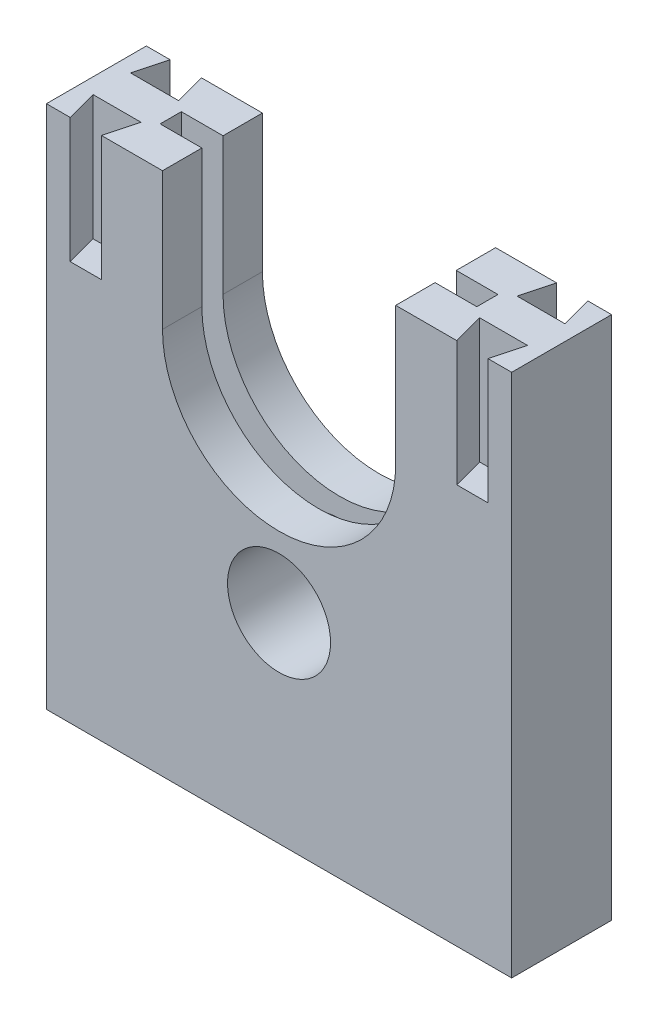
ISO-10303-21;
HEADER;
FILE_DESCRIPTION(('STEP AP214'),'2;1');
FILE_NAME('part.step','',(''),(''),'','','');
FILE_SCHEMA(('AUTOMOTIVE_DESIGN { 1 0 10303 214 1 1 1 1 }'));
ENDSEC;
DATA;
#1=APPLICATION_CONTEXT('core data for automotive mechanical design processes');
#2=APPLICATION_PROTOCOL_DEFINITION('international standard','automotive_design',2000,#1);
#3=PRODUCT_CONTEXT('',#1,'mechanical');
#4=PRODUCT('Part','Part','',(#3));
#5=PRODUCT_RELATED_PRODUCT_CATEGORY('part','',(#4));
#6=PRODUCT_DEFINITION_FORMATION('','',#4);
#7=PRODUCT_DEFINITION_CONTEXT('part definition',#1,'design');
#8=PRODUCT_DEFINITION('design','',#6,#7);
#9=PRODUCT_DEFINITION_SHAPE('','',#8);
#10=(LENGTH_UNIT() NAMED_UNIT(*) SI_UNIT(.MILLI.,.METRE.));
#11=(NAMED_UNIT(*) PLANE_ANGLE_UNIT() SI_UNIT($,.RADIAN.));
#12=(NAMED_UNIT(*) SI_UNIT($,.STERADIAN.) SOLID_ANGLE_UNIT());
#13=UNCERTAINTY_MEASURE_WITH_UNIT(LENGTH_MEASURE(1.E-05),#10,'distance_accuracy_value','');
#14=(GEOMETRIC_REPRESENTATION_CONTEXT(3) GLOBAL_UNCERTAINTY_ASSIGNED_CONTEXT((#13)) GLOBAL_UNIT_ASSIGNED_CONTEXT((#10,
#11,#12)) REPRESENTATION_CONTEXT('',''));
#15=CARTESIAN_POINT('',(0.,0.,0.));
#16=DIRECTION('',(0.,0.,1.));
#17=DIRECTION('',(1.,0.,0.));
#18=AXIS2_PLACEMENT_3D('',#15,#16,#17);
#19=CARTESIAN_POINT('',(0.,7.46153846153847,0.));
#20=DIRECTION('',(0.,-1.,0.));
#21=DIRECTION('',(0.,0.,-1.));
#22=AXIS2_PLACEMENT_3D('',#19,#20,#21);
#23=PLANE('',#22);
#24=DIRECTION('',(-1.,0.,0.));
#25=VECTOR('',#24,1.);
#26=CARTESIAN_POINT('',(-14.164150506298,7.46153846153847,3.15229744595904));
#27=LINE('',#26,#25);
#28=CARTESIAN_POINT('',(11.189791531939,7.46153846153847,3.15229744595904));
#29=VERTEX_POINT('',#28);
#30=CARTESIAN_POINT('',(2.51009255900295,7.46153846153847,3.15229744595904));
#31=VERTEX_POINT('',#30);
#32=EDGE_CURVE('E342',#29,#31,#27,.T.);
#33=ORIENTED_EDGE('',*,*,#32,.T.);
#34=DIRECTION('',(0.,0.,1.));
#35=VECTOR('',#34,1.);
#36=CARTESIAN_POINT('',(2.51009255900295,7.46153846153847,0.900000000000001));
#37=LINE('',#36,#35);
#38=CARTESIAN_POINT('',(2.51009255900295,7.46153846153847,4.84770255404097));
#39=VERTEX_POINT('',#38);
#40=EDGE_CURVE('E11',#31,#39,#37,.T.);
#41=ORIENTED_EDGE('',*,*,#40,.T.);
#42=DIRECTION('',(1.,0.,0.));
#43=VECTOR('',#42,1.);
#44=CARTESIAN_POINT('',(-14.164150506298,7.46153846153847,4.84770255404097));
#45=LINE('',#44,#43);
#46=CARTESIAN_POINT('',(11.189791531939,7.46153846153847,4.84770255404097));
#47=VERTEX_POINT('',#46);
#48=EDGE_CURVE('E350',#39,#47,#45,.T.);
#49=ORIENTED_EDGE('',*,*,#48,.T.);
#50=DIRECTION('',(0.,0.,-1.));
#51=VECTOR('',#50,1.);
#52=CARTESIAN_POINT('',(11.189791531939,7.46153846153847,4.84770255404097));
#53=LINE('',#52,#51);
#54=EDGE_CURVE('E336',#47,#29,#53,.T.);
#55=ORIENTED_EDGE('',*,*,#54,.T.);
#56=EDGE_LOOP('',(#33,#41,#49,#55));
#57=FACE_BOUND('',#56,.T.);
#58=ADVANCED_FACE('F43',(#57),#23,.F.);
#59=CARTESIAN_POINT('',(-1.4871794871795,21.4615384615385,-2.));
#60=DIRECTION('',(0.,0.,1.));
#61=DIRECTION('',(1.,0.,0.));
#62=AXIS2_PLACEMENT_3D('',#59,#60,#61);
#63=CYLINDRICAL_SURFACE('',#62,9.33629045959129);
#64=DIRECTION('',(0.,0.,1.));
#65=VECTOR('',#64,1.);
#66=CARTESIAN_POINT('',(7.84911097241179,21.4615384615385,-2.));
#67=LINE('',#66,#65);
#68=CARTESIAN_POINT('',(7.84911097241179,21.4615384615385,4.84770255404097));
#69=VERTEX_POINT('',#68);
#70=CARTESIAN_POINT('',(7.84911097241179,21.4615384615385,8.));
#71=VERTEX_POINT('',#70);
#72=EDGE_CURVE('E410',#69,#71,#67,.T.);
#73=ORIENTED_EDGE('',*,*,#72,.F.);
#74=CARTESIAN_POINT('',(-1.4871794871795,21.4615384615385,4.84770255404097));
#75=DIRECTION('',(0.,0.,1.));
#76=DIRECTION('',(1.,0.,0.));
#77=AXIS2_PLACEMENT_3D('',#74,#75,#76);
#78=CIRCLE('',#77,9.33629045959129);
#79=CARTESIAN_POINT('',(-10.8234699467708,21.4615384615385,4.84770255404097));
#80=VERTEX_POINT('',#79);
#81=EDGE_CURVE('E390',#69,#80,#78,.F.);
#82=ORIENTED_EDGE('',*,*,#81,.T.);
#83=DIRECTION('',(0.,0.,1.));
#84=VECTOR('',#83,1.);
#85=CARTESIAN_POINT('',(-10.8234699467708,21.4615384615385,-2.));
#86=LINE('',#85,#84);
#87=CARTESIAN_POINT('',(-10.8234699467708,21.4615384615385,8.));
#88=VERTEX_POINT('',#87);
#89=EDGE_CURVE('E416',#80,#88,#86,.T.);
#90=ORIENTED_EDGE('',*,*,#89,.T.);
#91=CARTESIAN_POINT('',(-1.4871794871795,21.4615384615385,8.));
#92=DIRECTION('',(0.,0.,1.));
#93=DIRECTION('',(1.,0.,0.));
#94=AXIS2_PLACEMENT_3D('',#91,#92,#93);
#95=CIRCLE('',#94,9.33629045959129);
#96=EDGE_CURVE('E398',#88,#71,#95,.T.);
#97=ORIENTED_EDGE('',*,*,#96,.T.);
#98=EDGE_LOOP('',(#73,#82,#90,#97));
#99=FACE_BOUND('',#98,.T.);
#100=ADVANCED_FACE('F705',(#99),#63,.F.);
#101=CARTESIAN_POINT('',(-10.8234699467708,21.4615384615385,-2.));
#102=DIRECTION('',(-1.,0.,0.));
#103=DIRECTION('',(0.,0.,1.));
#104=AXIS2_PLACEMENT_3D('',#101,#102,#103);
#105=PLANE('',#104);
#106=ORIENTED_EDGE('',*,*,#89,.F.);
#107=DIRECTION('',(0.,1.,0.));
#108=VECTOR('',#107,1.);
#109=CARTESIAN_POINT('',(-10.8234699467708,21.4615384615385,4.84770255404097));
#110=LINE('',#109,#108);
#111=CARTESIAN_POINT('',(-10.8234699467708,32.4615384615385,4.84770255404097));
#112=VERTEX_POINT('',#111);
#113=EDGE_CURVE('E394',#80,#112,#110,.T.);
#114=ORIENTED_EDGE('',*,*,#113,.T.);
#115=DIRECTION('',(0.,0.,1.));
#116=VECTOR('',#115,1.);
#117=CARTESIAN_POINT('',(-10.8234699467708,32.4615384615385,-2.));
#118=LINE('',#117,#116);
#119=CARTESIAN_POINT('',(-10.8234699467708,32.4615384615385,8.));
#120=VERTEX_POINT('',#119);
#121=EDGE_CURVE('E421',#112,#120,#118,.T.);
#122=ORIENTED_EDGE('',*,*,#121,.T.);
#123=DIRECTION('',(0.,-1.,0.));
#124=VECTOR('',#123,1.);
#125=CARTESIAN_POINT('',(-10.8234699467708,21.4615384615385,8.));
#126=LINE('',#125,#124);
#127=EDGE_CURVE('E406',#120,#88,#126,.T.);
#128=ORIENTED_EDGE('',*,*,#127,.T.);
#129=EDGE_LOOP('',(#106,#114,#122,#128));
#130=FACE_BOUND('',#129,.T.);
#131=ADVANCED_FACE('F642',(#130),#105,.F.);
#132=CARTESIAN_POINT('',(7.84911097241179,21.4615384615385,-2.));
#133=DIRECTION('',(1.,0.,0.));
#134=DIRECTION('',(0.,0.,-1.));
#135=AXIS2_PLACEMENT_3D('',#132,#133,#134);
#136=PLANE('',#135);
#137=DIRECTION('',(0.,0.,1.));
#138=VECTOR('',#137,1.);
#139=CARTESIAN_POINT('',(7.84911097241179,32.4615384615385,-2.));
#140=LINE('',#139,#138);
#141=CARTESIAN_POINT('',(7.84911097241179,32.4615384615385,4.84770255404097));
#142=VERTEX_POINT('',#141);
#143=CARTESIAN_POINT('',(7.84911097241179,32.4615384615385,8.));
#144=VERTEX_POINT('',#143);
#145=EDGE_CURVE('E426',#142,#144,#140,.T.);
#146=ORIENTED_EDGE('',*,*,#145,.F.);
#147=DIRECTION('',(0.,-1.,0.));
#148=VECTOR('',#147,1.);
#149=CARTESIAN_POINT('',(7.84911097241179,21.4615384615385,4.84770255404097));
#150=LINE('',#149,#148);
#151=EDGE_CURVE('E612',#142,#69,#150,.T.);
#152=ORIENTED_EDGE('',*,*,#151,.T.);
#153=ORIENTED_EDGE('',*,*,#72,.T.);
#154=DIRECTION('',(0.,1.,0.));
#155=VECTOR('',#154,1.);
#156=CARTESIAN_POINT('',(7.84911097241179,21.4615384615385,8.));
#157=LINE('',#156,#155);
#158=EDGE_CURVE('E402',#71,#144,#157,.T.);
#159=ORIENTED_EDGE('',*,*,#158,.T.);
#160=EDGE_LOOP('',(#146,#152,#153,#159));
#161=FACE_BOUND('',#160,.T.);
#162=ADVANCED_FACE('F703',(#161),#136,.F.);
#163=CARTESIAN_POINT('',(-19.4871794871795,32.4615384615385,8.));
#164=DIRECTION('',(0.,-1.,0.));
#165=DIRECTION('',(0.,0.,-1.));
#166=AXIS2_PLACEMENT_3D('',#163,#164,#165);
#167=PLANE('',#166);
#168=ORIENTED_EDGE('',*,*,#121,.F.);
#169=DIRECTION('',(1.,0.,0.));
#170=VECTOR('',#169,1.);
#171=CARTESIAN_POINT('',(-14.164150506298,32.4615384615385,4.84770255404097));
#172=LINE('',#171,#170);
#173=CARTESIAN_POINT('',(-14.164150506298,32.4615384615385,4.84770255404097));
#174=VERTEX_POINT('',#173);
#175=EDGE_CURVE('E341',#174,#112,#172,.T.);
#176=ORIENTED_EDGE('',*,*,#175,.F.);
#177=DIRECTION('',(0.,0.,1.));
#178=VECTOR('',#177,1.);
#179=CARTESIAN_POINT('',(-14.164150506298,32.4615384615385,4.84770255404097));
#180=LINE('',#179,#178);
#181=CARTESIAN_POINT('',(-14.164150506298,32.4615384615385,3.15229744595904));
#182=VERTEX_POINT('',#181);
#183=EDGE_CURVE('E362',#182,#174,#180,.T.);
#184=ORIENTED_EDGE('',*,*,#183,.F.);
#185=DIRECTION('',(-1.,0.,0.));
#186=VECTOR('',#185,1.);
#187=CARTESIAN_POINT('',(-14.164150506298,32.4615384615385,3.15229744595904));
#188=LINE('',#187,#186);
#189=CARTESIAN_POINT('',(-10.8234699467708,32.4615384615385,3.15229744595904));
#190=VERTEX_POINT('',#189);
#191=EDGE_CURVE('E359',#190,#182,#188,.T.);
#192=ORIENTED_EDGE('',*,*,#191,.F.);
#193=CARTESIAN_POINT('',(-10.8234699467708,32.4615384615385,0.));
#194=VERTEX_POINT('',#193);
#195=EDGE_CURVE('E417',#194,#190,#118,.T.);
#196=ORIENTED_EDGE('',*,*,#195,.F.);
#197=DIRECTION('',(-1.,0.,0.));
#198=VECTOR('',#197,1.);
#199=CARTESIAN_POINT('',(-19.4871794871795,32.4615384615385,0.));
#200=LINE('',#199,#198);
#201=CARTESIAN_POINT('',(-15.7121794871795,32.4615384615385,0.));
#202=VERTEX_POINT('',#201);
#203=EDGE_CURVE('E282',#194,#202,#200,.T.);
#204=ORIENTED_EDGE('',*,*,#203,.T.);
#205=DIRECTION('',(-0.258819045102518,0.,-0.965925826289069));
#206=VECTOR('',#205,1.);
#207=CARTESIAN_POINT('',(-15.0423065061017,32.4615384615385,2.5));
#208=LINE('',#207,#206);
#209=CARTESIAN_POINT('',(-15.0423065061017,32.4615384615385,2.5));
#210=VERTEX_POINT('',#209);
#211=EDGE_CURVE('E552',#210,#202,#208,.T.);
#212=ORIENTED_EDGE('',*,*,#211,.F.);
#213=DIRECTION('',(1.,0.,0.));
#214=VECTOR('',#213,1.);
#215=CARTESIAN_POINT('',(-18.8820524682573,32.4615384615385,2.5));
#216=LINE('',#215,#214);
#217=CARTESIAN_POINT('',(-18.8820524682573,32.4615384615385,2.5));
#218=VERTEX_POINT('',#217);
#219=EDGE_CURVE('E567',#218,#210,#216,.T.);
#220=ORIENTED_EDGE('',*,*,#219,.F.);
#221=DIRECTION('',(-0.258819045102517,0.,0.965925826289069));
#222=VECTOR('',#221,1.);
#223=CARTESIAN_POINT('',(-18.2121794871795,32.4615384615385,0.));
#224=LINE('',#223,#222);
#225=CARTESIAN_POINT('',(-18.2121794871795,32.4615384615385,0.));
#226=VERTEX_POINT('',#225);
#227=EDGE_CURVE('E497',#226,#218,#224,.T.);
#228=ORIENTED_EDGE('',*,*,#227,.F.);
#229=CARTESIAN_POINT('',(-20.1171794871795,32.4615384615385,0.));
#230=VERTEX_POINT('',#229);
#231=EDGE_CURVE('E596',#226,#230,#200,.T.);
#232=ORIENTED_EDGE('',*,*,#231,.T.);
#233=DIRECTION('',(0.,0.,1.));
#234=VECTOR('',#233,1.);
#235=CARTESIAN_POINT('',(-20.1171794871795,32.4615384615385,0.));
#236=LINE('',#235,#234);
#237=CARTESIAN_POINT('',(-20.1171794871795,32.4615384615385,8.));
#238=VERTEX_POINT('',#237);
#239=EDGE_CURVE('E300',#230,#238,#236,.T.);
#240=ORIENTED_EDGE('',*,*,#239,.T.);
#241=DIRECTION('',(-1.,0.,0.));
#242=VECTOR('',#241,1.);
#243=CARTESIAN_POINT('',(-19.4871794871795,32.4615384615385,8.));
#244=LINE('',#243,#242);
#245=CARTESIAN_POINT('',(-18.2121794871795,32.4615384615385,8.));
#246=VERTEX_POINT('',#245);
#247=EDGE_CURVE('E589',#246,#238,#244,.T.);
#248=ORIENTED_EDGE('',*,*,#247,.F.);
#249=DIRECTION('',(0.258819045102519,0.,0.965925826289069));
#250=VECTOR('',#249,1.);
#251=CARTESIAN_POINT('',(-18.2121794871795,32.4615384615385,8.));
#252=LINE('',#251,#250);
#253=CARTESIAN_POINT('',(-18.8820524682573,32.4615384615385,5.5));
#254=VERTEX_POINT('',#253);
#255=EDGE_CURVE('E485',#254,#246,#252,.T.);
#256=ORIENTED_EDGE('',*,*,#255,.F.);
#257=DIRECTION('',(-1.,0.,0.));
#258=VECTOR('',#257,1.);
#259=CARTESIAN_POINT('',(-18.8820524682573,32.4615384615385,5.5));
#260=LINE('',#259,#258);
#261=CARTESIAN_POINT('',(-15.0423065061017,32.4615384615385,5.5));
#262=VERTEX_POINT('',#261);
#263=EDGE_CURVE('E488',#262,#254,#260,.T.);
#264=ORIENTED_EDGE('',*,*,#263,.F.);
#265=DIRECTION('',(0.258819045102518,0.,-0.965925826289069));
#266=VECTOR('',#265,1.);
#267=CARTESIAN_POINT('',(-15.0423065061017,32.4615384615385,5.5));
#268=LINE('',#267,#266);
#269=CARTESIAN_POINT('',(-15.7121794871795,32.4615384615385,8.));
#270=VERTEX_POINT('',#269);
#271=EDGE_CURVE('E493',#270,#262,#268,.T.);
#272=ORIENTED_EDGE('',*,*,#271,.F.);
#273=EDGE_CURVE('E594',#120,#270,#244,.T.);
#274=ORIENTED_EDGE('',*,*,#273,.F.);
#275=EDGE_LOOP('',(#168,#176,#184,#192,#196,#204,#212,#220,#228,#232,#240,#248,#256,#264,#272,#274));
#276=FACE_BOUND('',#275,.T.);
#277=ADVANCED_FACE('F635',(#276),#167,.F.);
#278=CARTESIAN_POINT('',(-19.4871794871795,-9.53846153846153,8.));
#279=DIRECTION('',(0.,1.,0.));
#280=DIRECTION('',(0.,0.,1.));
#281=AXIS2_PLACEMENT_3D('',#278,#279,#280);
#282=PLANE('',#281);
#283=DIRECTION('',(1.,0.,0.));
#284=VECTOR('',#283,1.);
#285=CARTESIAN_POINT('',(-19.4871794871795,-9.53846153846153,0.));
#286=LINE('',#285,#284);
#287=CARTESIAN_POINT('',(-20.1171794871795,-9.53846153846153,0.));
#288=VERTEX_POINT('',#287);
#289=CARTESIAN_POINT('',(17.1331399106074,-9.53846153846153,0.));
#290=VERTEX_POINT('',#289);
#291=EDGE_CURVE('E578',#288,#290,#286,.T.);
#292=ORIENTED_EDGE('',*,*,#291,.T.);
#293=DIRECTION('',(0.,0.,-1.));
#294=VECTOR('',#293,1.);
#295=CARTESIAN_POINT('',(17.1331399106074,-9.53846153846153,0.));
#296=LINE('',#295,#294);
#297=CARTESIAN_POINT('',(17.1331399106074,-9.53846153846153,8.00000000000017));
#298=VERTEX_POINT('',#297);
#299=EDGE_CURVE('E289',#298,#290,#296,.T.);
#300=ORIENTED_EDGE('',*,*,#299,.F.);
#301=DIRECTION('',(1.,0.,0.));
#302=VECTOR('',#301,1.);
#303=CARTESIAN_POINT('',(-19.4871794871795,-9.53846153846153,8.));
#304=LINE('',#303,#302);
#305=CARTESIAN_POINT('',(-20.1171794871795,-9.53846153846153,8.));
#306=VERTEX_POINT('',#305);
#307=EDGE_CURVE('E279',#306,#298,#304,.T.);
#308=ORIENTED_EDGE('',*,*,#307,.F.);
#309=DIRECTION('',(0.,0.,1.));
#310=VECTOR('',#309,1.);
#311=CARTESIAN_POINT('',(-20.1171794871795,-9.53846153846153,0.));
#312=LINE('',#311,#310);
#313=EDGE_CURVE('E305',#288,#306,#312,.T.);
#314=ORIENTED_EDGE('',*,*,#313,.F.);
#315=EDGE_LOOP('',(#292,#300,#308,#314));
#316=FACE_BOUND('',#315,.T.);
#317=ADVANCED_FACE('F45',(#316),#282,.F.);
#318=DIRECTION('',(0.,0.,-1.));
#319=VECTOR('',#318,1.);
#320=CARTESIAN_POINT('',(11.189791531939,32.4615384615385,4.84770255404097));
#321=LINE('',#320,#319);
#322=CARTESIAN_POINT('',(11.189791531939,32.4615384615385,4.84770255404097));
#323=VERTEX_POINT('',#322);
#324=CARTESIAN_POINT('',(11.189791531939,32.4615384615385,3.15229744595904));
#325=VERTEX_POINT('',#324);
#326=EDGE_CURVE('E335',#323,#325,#321,.T.);
#327=ORIENTED_EDGE('',*,*,#326,.F.);
#328=EDGE_CURVE('E366',#142,#323,#172,.T.);
#329=ORIENTED_EDGE('',*,*,#328,.F.);
#330=ORIENTED_EDGE('',*,*,#145,.T.);
#331=CARTESIAN_POINT('',(12.7378205128205,32.4615384615385,8.));
#332=VERTEX_POINT('',#331);
#333=EDGE_CURVE('E593',#332,#144,#244,.T.);
#334=ORIENTED_EDGE('',*,*,#333,.F.);
#335=DIRECTION('',(0.258819045102525,0.,0.965925826289067));
#336=VECTOR('',#335,1.);
#337=CARTESIAN_POINT('',(12.0679475317427,32.4615384615385,5.5));
#338=LINE('',#337,#336);
#339=CARTESIAN_POINT('',(12.0679475317427,32.4615384615385,5.5));
#340=VERTEX_POINT('',#339);
#341=EDGE_CURVE('E444',#340,#332,#338,.T.);
#342=ORIENTED_EDGE('',*,*,#341,.F.);
#343=DIRECTION('',(-1.,0.,0.));
#344=VECTOR('',#343,1.);
#345=CARTESIAN_POINT('',(15.9076934938983,32.4615384615385,5.5));
#346=LINE('',#345,#344);
#347=CARTESIAN_POINT('',(15.9076934938983,32.4615384615385,5.5));
#348=VERTEX_POINT('',#347);
#349=EDGE_CURVE('E447',#348,#340,#346,.T.);
#350=ORIENTED_EDGE('',*,*,#349,.F.);
#351=DIRECTION('',(0.258819045102524,0.,-0.965925826289068));
#352=VECTOR('',#351,1.);
#353=CARTESIAN_POINT('',(15.2378205128205,32.4615384615385,8.));
#354=LINE('',#353,#352);
#355=CARTESIAN_POINT('',(15.2378205128205,32.4615384615385,8.));
#356=VERTEX_POINT('',#355);
#357=EDGE_CURVE('E452',#356,#348,#354,.T.);
#358=ORIENTED_EDGE('',*,*,#357,.F.);
#359=CARTESIAN_POINT('',(17.1331399106074,32.4615384615385,8.00000000000017));
#360=VERTEX_POINT('',#359);
#361=EDGE_CURVE('E297',#360,#356,#244,.T.);
#362=ORIENTED_EDGE('',*,*,#361,.F.);
#363=DIRECTION('',(0.,0.,-1.));
#364=VECTOR('',#363,1.);
#365=CARTESIAN_POINT('',(17.1331399106074,32.4615384615385,0.));
#366=LINE('',#365,#364);
#367=CARTESIAN_POINT('',(17.1331399106074,32.4615384615385,0.));
#368=VERTEX_POINT('',#367);
#369=EDGE_CURVE('E287',#360,#368,#366,.T.);
#370=ORIENTED_EDGE('',*,*,#369,.T.);
#371=CARTESIAN_POINT('',(15.2378205128205,32.4615384615385,0.));
#372=VERTEX_POINT('',#371);
#373=EDGE_CURVE('E266',#368,#372,#200,.T.);
#374=ORIENTED_EDGE('',*,*,#373,.T.);
#375=DIRECTION('',(-0.258819045102525,0.,-0.965925826289067));
#376=VECTOR('',#375,1.);
#377=CARTESIAN_POINT('',(15.2378205128205,32.4615384615385,0.));
#378=LINE('',#377,#376);
#379=CARTESIAN_POINT('',(15.9076934938983,32.4615384615385,2.5));
#380=VERTEX_POINT('',#379);
#381=EDGE_CURVE('E523',#380,#372,#378,.T.);
#382=ORIENTED_EDGE('',*,*,#381,.F.);
#383=DIRECTION('',(1.,0.,0.));
#384=VECTOR('',#383,1.);
#385=CARTESIAN_POINT('',(15.9076934938983,32.4615384615385,2.5));
#386=LINE('',#385,#384);
#387=CARTESIAN_POINT('',(12.0679475317427,32.4615384615385,2.5));
#388=VERTEX_POINT('',#387);
#389=EDGE_CURVE('E526',#388,#380,#386,.T.);
#390=ORIENTED_EDGE('',*,*,#389,.F.);
#391=DIRECTION('',(-0.258819045102525,0.,0.965925826289067));
#392=VECTOR('',#391,1.);
#393=CARTESIAN_POINT('',(12.0679475317427,32.4615384615385,2.5));
#394=LINE('',#393,#392);
#395=CARTESIAN_POINT('',(12.7378205128205,32.4615384615385,0.));
#396=VERTEX_POINT('',#395);
#397=EDGE_CURVE('E484',#396,#388,#394,.T.);
#398=ORIENTED_EDGE('',*,*,#397,.F.);
#399=CARTESIAN_POINT('',(7.84911097241179,32.4615384615385,0.));
#400=VERTEX_POINT('',#399);
#401=EDGE_CURVE('E280',#396,#400,#200,.T.);
#402=ORIENTED_EDGE('',*,*,#401,.T.);
#403=CARTESIAN_POINT('',(7.84911097241179,32.4615384615385,3.15229744595904));
#404=VERTEX_POINT('',#403);
#405=EDGE_CURVE('E422',#400,#404,#140,.T.);
#406=ORIENTED_EDGE('',*,*,#405,.T.);
#407=EDGE_CURVE('E67',#325,#404,#188,.T.);
#408=ORIENTED_EDGE('',*,*,#407,.F.);
#409=EDGE_LOOP('',(#327,#329,#330,#334,#342,#350,#358,#362,#370,#374,#382,#390,#398,#402,#406,#408));
#410=FACE_BOUND('',#409,.T.);
#411=ADVANCED_FACE('F294',(#410),#167,.F.);
#412=CARTESIAN_POINT('',(0.,0.,8.));
#413=DIRECTION('',(0.,0.,1.));
#414=DIRECTION('',(1.,0.,0.));
#415=AXIS2_PLACEMENT_3D('',#412,#413,#414);
#416=PLANE('',#415);
#417=CARTESIAN_POINT('',(-1.49186008939257,6.46153846153844,8.));
#418=DIRECTION('',(0.,0.,1.));
#419=DIRECTION('',(1.,0.,0.));
#420=AXIS2_PLACEMENT_3D('',#417,#418,#419);
#421=CIRCLE('',#420,4.125);
#422=CARTESIAN_POINT('',(2.63313991060743,6.46153846153844,8.));
#423=VERTEX_POINT('',#422);
#424=EDGE_CURVE('E318',#423,#423,#421,.T.);
#425=ORIENTED_EDGE('',*,*,#424,.F.);
#426=EDGE_LOOP('',(#425));
#427=FACE_BOUND('',#426,.T.);
#428=ORIENTED_EDGE('',*,*,#127,.F.);
#429=ORIENTED_EDGE('',*,*,#273,.T.);
#430=DIRECTION('',(0.,1.,0.));
#431=VECTOR('',#430,1.);
#432=CARTESIAN_POINT('',(-15.7121794871795,22.4615384615385,8.));
#433=LINE('',#432,#431);
#434=CARTESIAN_POINT('',(-15.7121794871795,22.4615384615385,8.));
#435=VERTEX_POINT('',#434);
#436=EDGE_CURVE('E469',#435,#270,#433,.T.);
#437=ORIENTED_EDGE('',*,*,#436,.F.);
#438=DIRECTION('',(1.,0.,0.));
#439=VECTOR('',#438,1.);
#440=CARTESIAN_POINT('',(-18.2121794871795,22.4615384615385,8.));
#441=LINE('',#440,#439);
#442=CARTESIAN_POINT('',(-18.2121794871795,22.4615384615385,8.));
#443=VERTEX_POINT('',#442);
#444=EDGE_CURVE('E489',#443,#435,#441,.T.);
#445=ORIENTED_EDGE('',*,*,#444,.F.);
#446=DIRECTION('',(0.,1.,0.));
#447=VECTOR('',#446,1.);
#448=CARTESIAN_POINT('',(-18.2121794871795,22.4615384615385,8.));
#449=LINE('',#448,#447);
#450=EDGE_CURVE('E480',#443,#246,#449,.T.);
#451=ORIENTED_EDGE('',*,*,#450,.T.);
#452=ORIENTED_EDGE('',*,*,#247,.T.);
#453=DIRECTION('',(0.,1.,0.));
#454=VECTOR('',#453,1.);
#455=CARTESIAN_POINT('',(-20.1171794871795,-9.53846153846153,8.));
#456=LINE('',#455,#454);
#457=EDGE_CURVE('E314',#306,#238,#456,.T.);
#458=ORIENTED_EDGE('',*,*,#457,.F.);
#459=ORIENTED_EDGE('',*,*,#307,.T.);
#460=DIRECTION('',(0.,1.,0.));
#461=VECTOR('',#460,1.);
#462=CARTESIAN_POINT('',(17.1331399106074,-9.53846153846153,8.00000000000017));
#463=LINE('',#462,#461);
#464=EDGE_CURVE('E291',#298,#360,#463,.T.);
#465=ORIENTED_EDGE('',*,*,#464,.T.);
#466=ORIENTED_EDGE('',*,*,#361,.T.);
#467=DIRECTION('',(0.,1.,0.));
#468=VECTOR('',#467,1.);
#469=CARTESIAN_POINT('',(15.2378205128205,22.4615384615385,8.));
#470=LINE('',#469,#468);
#471=CARTESIAN_POINT('',(15.2378205128205,22.4615384615385,8.));
#472=VERTEX_POINT('',#471);
#473=EDGE_CURVE('E431',#472,#356,#470,.T.);
#474=ORIENTED_EDGE('',*,*,#473,.F.);
#475=DIRECTION('',(1.,0.,0.));
#476=VECTOR('',#475,1.);
#477=CARTESIAN_POINT('',(15.2378205128205,22.4615384615385,8.));
#478=LINE('',#477,#476);
#479=CARTESIAN_POINT('',(12.7378205128205,22.4615384615385,8.));
#480=VERTEX_POINT('',#479);
#481=EDGE_CURVE('E448',#480,#472,#478,.T.);
#482=ORIENTED_EDGE('',*,*,#481,.F.);
#483=DIRECTION('',(0.,1.,0.));
#484=VECTOR('',#483,1.);
#485=CARTESIAN_POINT('',(12.7378205128205,22.4615384615385,8.));
#486=LINE('',#485,#484);
#487=EDGE_CURVE('E415',#480,#332,#486,.T.);
#488=ORIENTED_EDGE('',*,*,#487,.T.);
#489=ORIENTED_EDGE('',*,*,#333,.T.);
#490=ORIENTED_EDGE('',*,*,#158,.F.);
#491=ORIENTED_EDGE('',*,*,#96,.F.);
#492=EDGE_LOOP('',(#428,#429,#437,#445,#451,#452,#458,#459,#465,#466,#474,#482,#488,#489,#490,#491));
#493=FACE_BOUND('',#492,.T.);
#494=ADVANCED_FACE('F687',(#427,#493),#416,.T.);
#495=CARTESIAN_POINT('',(0.,0.,0.));
#496=DIRECTION('',(0.,0.,1.));
#497=DIRECTION('',(1.,0.,0.));
#498=AXIS2_PLACEMENT_3D('',#495,#496,#497);
#499=PLANE('',#498);
#500=ORIENTED_EDGE('',*,*,#203,.F.);
#501=DIRECTION('',(0.,-1.,0.));
#502=VECTOR('',#501,1.);
#503=CARTESIAN_POINT('',(-10.8234699467708,0.,0.));
#504=LINE('',#503,#502);
#505=CARTESIAN_POINT('',(-10.8234699467708,21.4615384615385,0.));
#506=VERTEX_POINT('',#505);
#507=EDGE_CURVE('E605',#194,#506,#504,.T.);
#508=ORIENTED_EDGE('',*,*,#507,.T.);
#509=CARTESIAN_POINT('',(-1.4871794871795,21.4615384615385,0.));
#510=DIRECTION('',(0.,0.,1.));
#511=DIRECTION('',(1.,0.,0.));
#512=AXIS2_PLACEMENT_3D('',#509,#510,#511);
#513=CIRCLE('',#512,9.33629045959129);
#514=CARTESIAN_POINT('',(7.84911097241179,21.4615384615385,0.));
#515=VERTEX_POINT('',#514);
#516=EDGE_CURVE('E601',#506,#515,#513,.T.);
#517=ORIENTED_EDGE('',*,*,#516,.T.);
#518=DIRECTION('',(0.,1.,0.));
#519=VECTOR('',#518,1.);
#520=CARTESIAN_POINT('',(7.84911097241179,0.,0.));
#521=LINE('',#520,#519);
#522=EDGE_CURVE('E592',#515,#400,#521,.T.);
#523=ORIENTED_EDGE('',*,*,#522,.T.);
#524=ORIENTED_EDGE('',*,*,#401,.F.);
#525=DIRECTION('',(0.,1.,0.));
#526=VECTOR('',#525,1.);
#527=CARTESIAN_POINT('',(12.7378205128205,22.4615384615385,0.));
#528=LINE('',#527,#526);
#529=CARTESIAN_POINT('',(12.7378205128205,22.4615384615385,0.));
#530=VERTEX_POINT('',#529);
#531=EDGE_CURVE('E511',#530,#396,#528,.T.);
#532=ORIENTED_EDGE('',*,*,#531,.F.);
#533=DIRECTION('',(-1.,0.,0.));
#534=VECTOR('',#533,1.);
#535=CARTESIAN_POINT('',(15.2378205128205,22.4615384615385,0.));
#536=LINE('',#535,#534);
#537=CARTESIAN_POINT('',(15.2378205128205,22.4615384615385,0.));
#538=VERTEX_POINT('',#537);
#539=EDGE_CURVE('E527',#538,#530,#536,.T.);
#540=ORIENTED_EDGE('',*,*,#539,.F.);
#541=DIRECTION('',(0.,1.,0.));
#542=VECTOR('',#541,1.);
#543=CARTESIAN_POINT('',(15.2378205128205,22.4615384615385,0.));
#544=LINE('',#543,#542);
#545=EDGE_CURVE('E274',#538,#372,#544,.T.);
#546=ORIENTED_EDGE('',*,*,#545,.T.);
#547=ORIENTED_EDGE('',*,*,#373,.F.);
#548=DIRECTION('',(0.,1.,0.));
#549=VECTOR('',#548,1.);
#550=CARTESIAN_POINT('',(17.1331399106074,-9.53846153846153,0.));
#551=LINE('',#550,#549);
#552=EDGE_CURVE('E270',#290,#368,#551,.T.);
#553=ORIENTED_EDGE('',*,*,#552,.F.);
#554=ORIENTED_EDGE('',*,*,#291,.F.);
#555=DIRECTION('',(0.,1.,0.));
#556=VECTOR('',#555,1.);
#557=CARTESIAN_POINT('',(-20.1171794871795,-9.53846153846153,0.));
#558=LINE('',#557,#556);
#559=EDGE_CURVE('E312',#288,#230,#558,.T.);
#560=ORIENTED_EDGE('',*,*,#559,.T.);
#561=ORIENTED_EDGE('',*,*,#231,.F.);
#562=DIRECTION('',(0.,1.,0.));
#563=VECTOR('',#562,1.);
#564=CARTESIAN_POINT('',(-18.2121794871795,22.4615384615385,0.));
#565=LINE('',#564,#563);
#566=CARTESIAN_POINT('',(-18.2121794871795,22.4615384615385,0.));
#567=VERTEX_POINT('',#566);
#568=EDGE_CURVE('E563',#567,#226,#565,.T.);
#569=ORIENTED_EDGE('',*,*,#568,.F.);
#570=DIRECTION('',(-1.,0.,0.));
#571=VECTOR('',#570,1.);
#572=CARTESIAN_POINT('',(-15.7121794871795,22.4615384615385,0.));
#573=LINE('',#572,#571);
#574=CARTESIAN_POINT('',(-15.7121794871795,22.4615384615385,0.));
#575=VERTEX_POINT('',#574);
#576=EDGE_CURVE('E547',#575,#567,#573,.T.);
#577=ORIENTED_EDGE('',*,*,#576,.F.);
#578=DIRECTION('',(0.,1.,0.));
#579=VECTOR('',#578,1.);
#580=CARTESIAN_POINT('',(-15.7121794871795,22.4615384615385,0.));
#581=LINE('',#580,#579);
#582=EDGE_CURVE('E574',#575,#202,#581,.T.);
#583=ORIENTED_EDGE('',*,*,#582,.T.);
#584=EDGE_LOOP('',(#500,#508,#517,#523,#524,#532,#540,#546,#547,#553,#554,#560,#561,#569,#577,#583));
#585=FACE_BOUND('',#584,.T.);
#586=ADVANCED_FACE('F269',(#585),#499,.F.);
#587=CARTESIAN_POINT('',(-15.0423065061017,22.4615384615385,2.5));
#588=DIRECTION('',(0.965925826289069,0.,-0.258819045102518));
#589=DIRECTION('',(-0.258819045102518,0.,-0.965925826289069));
#590=AXIS2_PLACEMENT_3D('',#587,#588,#589);
#591=PLANE('',#590);
#592=ORIENTED_EDGE('',*,*,#211,.T.);
#593=ORIENTED_EDGE('',*,*,#582,.F.);
#594=DIRECTION('',(-0.258819045102518,0.,-0.965925826289069));
#595=VECTOR('',#594,1.);
#596=CARTESIAN_POINT('',(-15.0423065061017,22.4615384615385,2.5));
#597=LINE('',#596,#595);
#598=CARTESIAN_POINT('',(-15.0423065061017,22.4615384615385,2.5));
#599=VERTEX_POINT('',#598);
#600=EDGE_CURVE('E560',#599,#575,#597,.T.);
#601=ORIENTED_EDGE('',*,*,#600,.F.);
#602=DIRECTION('',(0.,1.,0.));
#603=VECTOR('',#602,1.);
#604=CARTESIAN_POINT('',(-15.0423065061017,22.4615384615385,2.5));
#605=LINE('',#604,#603);
#606=EDGE_CURVE('E579',#599,#210,#605,.T.);
#607=ORIENTED_EDGE('',*,*,#606,.T.);
#608=EDGE_LOOP('',(#592,#593,#601,#607));
#609=FACE_BOUND('',#608,.T.);
#610=ADVANCED_FACE('F793',(#609),#591,.F.);
#611=CARTESIAN_POINT('',(-18.8820524682573,22.4615384615385,2.5));
#612=DIRECTION('',(0.,0.,1.));
#613=DIRECTION('',(1.,0.,0.));
#614=AXIS2_PLACEMENT_3D('',#611,#612,#613);
#615=PLANE('',#614);
#616=ORIENTED_EDGE('',*,*,#219,.T.);
#617=ORIENTED_EDGE('',*,*,#606,.F.);
#618=DIRECTION('',(1.,0.,0.));
#619=VECTOR('',#618,1.);
#620=CARTESIAN_POINT('',(-18.8820524682573,22.4615384615385,2.5));
#621=LINE('',#620,#619);
#622=CARTESIAN_POINT('',(-18.8820524682573,22.4615384615385,2.5));
#623=VERTEX_POINT('',#622);
#624=EDGE_CURVE('E556',#623,#599,#621,.T.);
#625=ORIENTED_EDGE('',*,*,#624,.F.);
#626=DIRECTION('',(0.,1.,0.));
#627=VECTOR('',#626,1.);
#628=CARTESIAN_POINT('',(-18.8820524682573,22.4615384615385,2.5));
#629=LINE('',#628,#627);
#630=EDGE_CURVE('E582',#623,#218,#629,.T.);
#631=ORIENTED_EDGE('',*,*,#630,.T.);
#632=EDGE_LOOP('',(#616,#617,#625,#631));
#633=FACE_BOUND('',#632,.T.);
#634=ADVANCED_FACE('F801',(#633),#615,.F.);
#635=CARTESIAN_POINT('',(-18.2121794871795,22.4615384615385,0.));
#636=DIRECTION('',(-0.965925826289069,0.,-0.258819045102517));
#637=DIRECTION('',(-0.258819045102517,0.,0.965925826289069));
#638=AXIS2_PLACEMENT_3D('',#635,#636,#637);
#639=PLANE('',#638);
#640=ORIENTED_EDGE('',*,*,#227,.T.);
#641=ORIENTED_EDGE('',*,*,#630,.F.);
#642=DIRECTION('',(-0.258819045102517,0.,0.965925826289069));
#643=VECTOR('',#642,1.);
#644=CARTESIAN_POINT('',(-18.2121794871795,22.4615384615385,0.));
#645=LINE('',#644,#643);
#646=EDGE_CURVE('E551',#567,#623,#645,.T.);
#647=ORIENTED_EDGE('',*,*,#646,.F.);
#648=ORIENTED_EDGE('',*,*,#568,.T.);
#649=EDGE_LOOP('',(#640,#641,#647,#648));
#650=FACE_BOUND('',#649,.T.);
#651=ADVANCED_FACE('F797',(#650),#639,.F.);
#652=CARTESIAN_POINT('',(0.,22.4615384615385,0.));
#653=DIRECTION('',(0.,1.,0.));
#654=DIRECTION('',(0.,0.,1.));
#655=AXIS2_PLACEMENT_3D('',#652,#653,#654);
#656=PLANE('',#655);
#657=ORIENTED_EDGE('',*,*,#576,.T.);
#658=ORIENTED_EDGE('',*,*,#646,.T.);
#659=ORIENTED_EDGE('',*,*,#624,.T.);
#660=ORIENTED_EDGE('',*,*,#600,.T.);
#661=EDGE_LOOP('',(#657,#658,#659,#660));
#662=FACE_BOUND('',#661,.T.);
#663=ADVANCED_FACE('F800',(#662),#656,.T.);
#664=CARTESIAN_POINT('',(15.2378205128205,22.4615384615385,0.));
#665=DIRECTION('',(0.965925826289067,0.,-0.258819045102525));
#666=DIRECTION('',(-0.258819045102526,0.,-0.965925826289067));
#667=AXIS2_PLACEMENT_3D('',#664,#665,#666);
#668=PLANE('',#667);
#669=ORIENTED_EDGE('',*,*,#381,.T.);
#670=ORIENTED_EDGE('',*,*,#545,.F.);
#671=DIRECTION('',(-0.258819045102525,0.,-0.965925826289067));
#672=VECTOR('',#671,1.);
#673=CARTESIAN_POINT('',(15.2378205128205,22.4615384615385,0.));
#674=LINE('',#673,#672);
#675=CARTESIAN_POINT('',(15.9076934938983,22.4615384615385,2.5));
#676=VERTEX_POINT('',#675);
#677=EDGE_CURVE('E514',#676,#538,#674,.T.);
#678=ORIENTED_EDGE('',*,*,#677,.F.);
#679=DIRECTION('',(0.,1.,0.));
#680=VECTOR('',#679,1.);
#681=CARTESIAN_POINT('',(15.9076934938983,22.4615384615385,2.5));
#682=LINE('',#681,#680);
#683=EDGE_CURVE('E518',#676,#380,#682,.T.);
#684=ORIENTED_EDGE('',*,*,#683,.T.);
#685=EDGE_LOOP('',(#669,#670,#678,#684));
#686=FACE_BOUND('',#685,.T.);
#687=ADVANCED_FACE('F811',(#686),#668,.F.);
#688=CARTESIAN_POINT('',(15.9076934938983,22.4615384615385,2.5));
#689=DIRECTION('',(0.,0.,1.));
#690=DIRECTION('',(1.,0.,0.));
#691=AXIS2_PLACEMENT_3D('',#688,#689,#690);
#692=PLANE('',#691);
#693=ORIENTED_EDGE('',*,*,#389,.T.);
#694=ORIENTED_EDGE('',*,*,#683,.F.);
#695=DIRECTION('',(1.,0.,0.));
#696=VECTOR('',#695,1.);
#697=CARTESIAN_POINT('',(15.9076934938983,22.4615384615385,2.5));
#698=LINE('',#697,#696);
#699=CARTESIAN_POINT('',(12.0679475317427,22.4615384615385,2.5));
#700=VERTEX_POINT('',#699);
#701=EDGE_CURVE('E536',#700,#676,#698,.T.);
#702=ORIENTED_EDGE('',*,*,#701,.F.);
#703=DIRECTION('',(0.,1.,0.));
#704=VECTOR('',#703,1.);
#705=CARTESIAN_POINT('',(12.0679475317427,22.4615384615385,2.5));
#706=LINE('',#705,#704);
#707=EDGE_CURVE('E515',#700,#388,#706,.T.);
#708=ORIENTED_EDGE('',*,*,#707,.T.);
#709=EDGE_LOOP('',(#693,#694,#702,#708));
#710=FACE_BOUND('',#709,.T.);
#711=ADVANCED_FACE('F819',(#710),#692,.F.);
#712=CARTESIAN_POINT('',(12.0679475317427,22.4615384615385,2.5));
#713=DIRECTION('',(-0.965925826289067,0.,-0.258819045102525));
#714=DIRECTION('',(-0.258819045102525,0.,0.965925826289067));
#715=AXIS2_PLACEMENT_3D('',#712,#713,#714);
#716=PLANE('',#715);
#717=ORIENTED_EDGE('',*,*,#397,.T.);
#718=ORIENTED_EDGE('',*,*,#707,.F.);
#719=DIRECTION('',(-0.258819045102525,0.,0.965925826289067));
#720=VECTOR('',#719,1.);
#721=CARTESIAN_POINT('',(12.0679475317427,22.4615384615385,2.5));
#722=LINE('',#721,#720);
#723=EDGE_CURVE('E540',#530,#700,#722,.T.);
#724=ORIENTED_EDGE('',*,*,#723,.F.);
#725=ORIENTED_EDGE('',*,*,#531,.T.);
#726=EDGE_LOOP('',(#717,#718,#724,#725));
#727=FACE_BOUND('',#726,.T.);
#728=ADVANCED_FACE('F815',(#727),#716,.F.);
#729=CARTESIAN_POINT('',(0.,22.4615384615385,0.));
#730=DIRECTION('',(0.,-1.,0.));
#731=DIRECTION('',(0.,0.,-1.));
#732=AXIS2_PLACEMENT_3D('',#729,#730,#731);
#733=PLANE('',#732);
#734=ORIENTED_EDGE('',*,*,#539,.T.);
#735=ORIENTED_EDGE('',*,*,#723,.T.);
#736=ORIENTED_EDGE('',*,*,#701,.T.);
#737=ORIENTED_EDGE('',*,*,#677,.T.);
#738=EDGE_LOOP('',(#734,#735,#736,#737));
#739=FACE_BOUND('',#738,.T.);
#740=ADVANCED_FACE('F770',(#739),#733,.F.);
#741=CARTESIAN_POINT('',(12.0679475317427,22.4615384615385,5.5));
#742=DIRECTION('',(-0.965925826289067,0.,0.258819045102525));
#743=DIRECTION('',(0.258819045102525,0.,0.965925826289067));
#744=AXIS2_PLACEMENT_3D('',#741,#742,#743);
#745=PLANE('',#744);
#746=ORIENTED_EDGE('',*,*,#341,.T.);
#747=ORIENTED_EDGE('',*,*,#487,.F.);
#748=DIRECTION('',(0.258819045102525,0.,0.965925826289067));
#749=VECTOR('',#748,1.);
#750=CARTESIAN_POINT('',(12.0679475317427,22.4615384615385,5.5));
#751=LINE('',#750,#749);
#752=CARTESIAN_POINT('',(12.0679475317427,22.4615384615385,5.5));
#753=VERTEX_POINT('',#752);
#754=EDGE_CURVE('E434',#753,#480,#751,.T.);
#755=ORIENTED_EDGE('',*,*,#754,.F.);
#756=DIRECTION('',(0.,1.,0.));
#757=VECTOR('',#756,1.);
#758=CARTESIAN_POINT('',(12.0679475317427,22.4615384615385,5.5));
#759=LINE('',#758,#757);
#760=EDGE_CURVE('E438',#753,#340,#759,.T.);
#761=ORIENTED_EDGE('',*,*,#760,.T.);
#762=EDGE_LOOP('',(#746,#747,#755,#761));
#763=FACE_BOUND('',#762,.T.);
#764=ADVANCED_FACE('F766',(#763),#745,.F.);
#765=CARTESIAN_POINT('',(15.9076934938983,22.4615384615385,5.5));
#766=DIRECTION('',(0.,0.,-1.));
#767=DIRECTION('',(-1.,0.,0.));
#768=AXIS2_PLACEMENT_3D('',#765,#766,#767);
#769=PLANE('',#768);
#770=ORIENTED_EDGE('',*,*,#349,.T.);
#771=ORIENTED_EDGE('',*,*,#760,.F.);
#772=DIRECTION('',(-1.,0.,0.));
#773=VECTOR('',#772,1.);
#774=CARTESIAN_POINT('',(15.9076934938983,22.4615384615385,5.5));
#775=LINE('',#774,#773);
#776=CARTESIAN_POINT('',(15.9076934938983,22.4615384615385,5.5));
#777=VERTEX_POINT('',#776);
#778=EDGE_CURVE('E458',#777,#753,#775,.T.);
#779=ORIENTED_EDGE('',*,*,#778,.F.);
#780=DIRECTION('',(0.,1.,0.));
#781=VECTOR('',#780,1.);
#782=CARTESIAN_POINT('',(15.9076934938983,22.4615384615385,5.5));
#783=LINE('',#782,#781);
#784=EDGE_CURVE('E435',#777,#348,#783,.T.);
#785=ORIENTED_EDGE('',*,*,#784,.T.);
#786=EDGE_LOOP('',(#770,#771,#779,#785));
#787=FACE_BOUND('',#786,.T.);
#788=ADVANCED_FACE('F762',(#787),#769,.F.);
#789=CARTESIAN_POINT('',(15.2378205128205,22.4615384615385,8.));
#790=DIRECTION('',(0.965925826289068,0.,0.258819045102524));
#791=DIRECTION('',(0.258819045102524,0.,-0.965925826289068));
#792=AXIS2_PLACEMENT_3D('',#789,#790,#791);
#793=PLANE('',#792);
#794=ORIENTED_EDGE('',*,*,#357,.T.);
#795=ORIENTED_EDGE('',*,*,#784,.F.);
#796=DIRECTION('',(0.258819045102524,0.,-0.965925826289068));
#797=VECTOR('',#796,1.);
#798=CARTESIAN_POINT('',(15.2378205128205,22.4615384615385,8.));
#799=LINE('',#798,#797);
#800=EDGE_CURVE('E462',#472,#777,#799,.T.);
#801=ORIENTED_EDGE('',*,*,#800,.F.);
#802=ORIENTED_EDGE('',*,*,#473,.T.);
#803=EDGE_LOOP('',(#794,#795,#801,#802));
#804=FACE_BOUND('',#803,.T.);
#805=ADVANCED_FACE('F759',(#804),#793,.F.);
#806=CARTESIAN_POINT('',(0.,22.4615384615385,0.));
#807=DIRECTION('',(0.,1.,0.));
#808=DIRECTION('',(0.,0.,1.));
#809=AXIS2_PLACEMENT_3D('',#806,#807,#808);
#810=PLANE('',#809);
#811=ORIENTED_EDGE('',*,*,#481,.T.);
#812=ORIENTED_EDGE('',*,*,#800,.T.);
#813=ORIENTED_EDGE('',*,*,#778,.T.);
#814=ORIENTED_EDGE('',*,*,#754,.T.);
#815=EDGE_LOOP('',(#811,#812,#813,#814));
#816=FACE_BOUND('',#815,.T.);
#817=ADVANCED_FACE('F726',(#816),#810,.T.);
#818=CARTESIAN_POINT('',(-18.2121794871795,22.4615384615385,8.));
#819=DIRECTION('',(-0.965925826289069,0.,0.258819045102519));
#820=DIRECTION('',(0.258819045102519,0.,0.965925826289069));
#821=AXIS2_PLACEMENT_3D('',#818,#819,#820);
#822=PLANE('',#821);
#823=ORIENTED_EDGE('',*,*,#255,.T.);
#824=ORIENTED_EDGE('',*,*,#450,.F.);
#825=DIRECTION('',(0.258819045102519,0.,0.965925826289069));
#826=VECTOR('',#825,1.);
#827=CARTESIAN_POINT('',(-18.2121794871795,22.4615384615385,8.));
#828=LINE('',#827,#826);
#829=CARTESIAN_POINT('',(-18.8820524682573,22.4615384615385,5.5));
#830=VERTEX_POINT('',#829);
#831=EDGE_CURVE('E473',#830,#443,#828,.T.);
#832=ORIENTED_EDGE('',*,*,#831,.F.);
#833=DIRECTION('',(0.,1.,0.));
#834=VECTOR('',#833,1.);
#835=CARTESIAN_POINT('',(-18.8820524682573,22.4615384615385,5.5));
#836=LINE('',#835,#834);
#837=EDGE_CURVE('E477',#830,#254,#836,.T.);
#838=ORIENTED_EDGE('',*,*,#837,.T.);
#839=EDGE_LOOP('',(#823,#824,#832,#838));
#840=FACE_BOUND('',#839,.T.);
#841=ADVANCED_FACE('F716',(#840),#822,.F.);
#842=CARTESIAN_POINT('',(-18.8820524682573,22.4615384615385,5.5));
#843=DIRECTION('',(0.,0.,-1.));
#844=DIRECTION('',(-1.,0.,0.));
#845=AXIS2_PLACEMENT_3D('',#842,#843,#844);
#846=PLANE('',#845);
#847=ORIENTED_EDGE('',*,*,#263,.T.);
#848=ORIENTED_EDGE('',*,*,#837,.F.);
#849=DIRECTION('',(-1.,0.,0.));
#850=VECTOR('',#849,1.);
#851=CARTESIAN_POINT('',(-18.8820524682573,22.4615384615385,5.5));
#852=LINE('',#851,#850);
#853=CARTESIAN_POINT('',(-15.0423065061017,22.4615384615385,5.5));
#854=VERTEX_POINT('',#853);
#855=EDGE_CURVE('E500',#854,#830,#852,.T.);
#856=ORIENTED_EDGE('',*,*,#855,.F.);
#857=DIRECTION('',(0.,1.,0.));
#858=VECTOR('',#857,1.);
#859=CARTESIAN_POINT('',(-15.0423065061017,22.4615384615385,5.5));
#860=LINE('',#859,#858);
#861=EDGE_CURVE('E474',#854,#262,#860,.T.);
#862=ORIENTED_EDGE('',*,*,#861,.T.);
#863=EDGE_LOOP('',(#847,#848,#856,#862));
#864=FACE_BOUND('',#863,.T.);
#865=ADVANCED_FACE('F718',(#864),#846,.F.);
#866=CARTESIAN_POINT('',(-15.0423065061017,22.4615384615385,5.5));
#867=DIRECTION('',(0.965925826289069,0.,0.258819045102518));
#868=DIRECTION('',(0.258819045102518,0.,-0.965925826289069));
#869=AXIS2_PLACEMENT_3D('',#866,#867,#868);
#870=PLANE('',#869);
#871=ORIENTED_EDGE('',*,*,#271,.T.);
#872=ORIENTED_EDGE('',*,*,#861,.F.);
#873=DIRECTION('',(0.258819045102518,0.,-0.965925826289069));
#874=VECTOR('',#873,1.);
#875=CARTESIAN_POINT('',(-15.0423065061017,22.4615384615385,5.5));
#876=LINE('',#875,#874);
#877=EDGE_CURVE('E504',#435,#854,#876,.T.);
#878=ORIENTED_EDGE('',*,*,#877,.F.);
#879=ORIENTED_EDGE('',*,*,#436,.T.);
#880=EDGE_LOOP('',(#871,#872,#878,#879));
#881=FACE_BOUND('',#880,.T.);
#882=ADVANCED_FACE('F710',(#881),#870,.F.);
#883=CARTESIAN_POINT('',(0.,22.4615384615385,0.));
#884=DIRECTION('',(0.,-1.,0.));
#885=DIRECTION('',(0.,0.,-1.));
#886=AXIS2_PLACEMENT_3D('',#883,#884,#885);
#887=PLANE('',#886);
#888=ORIENTED_EDGE('',*,*,#444,.T.);
#889=ORIENTED_EDGE('',*,*,#877,.T.);
#890=ORIENTED_EDGE('',*,*,#855,.T.);
#891=ORIENTED_EDGE('',*,*,#831,.T.);
#892=EDGE_LOOP('',(#888,#889,#890,#891));
#893=FACE_BOUND('',#892,.T.);
#894=ADVANCED_FACE('F713',(#893),#887,.F.);
#895=CARTESIAN_POINT('',(-10.8234699467708,21.4615384615385,3.15229744595904));
#896=VERTEX_POINT('',#895);
#897=EDGE_CURVE('E411',#506,#896,#86,.T.);
#898=ORIENTED_EDGE('',*,*,#897,.T.);
#899=CARTESIAN_POINT('',(-1.4871794871795,21.4615384615385,3.15229744595904));
#900=DIRECTION('',(0.,0.,-1.));
#901=DIRECTION('',(-1.,0.,0.));
#902=AXIS2_PLACEMENT_3D('',#899,#900,#901);
#903=CIRCLE('',#902,9.33629045959129);
#904=CARTESIAN_POINT('',(7.84911097241179,21.4615384615385,3.15229744595904));
#905=VERTEX_POINT('',#904);
#906=EDGE_CURVE('E373',#896,#905,#903,.F.);
#907=ORIENTED_EDGE('',*,*,#906,.T.);
#908=EDGE_CURVE('E427',#515,#905,#67,.T.);
#909=ORIENTED_EDGE('',*,*,#908,.F.);
#910=ORIENTED_EDGE('',*,*,#516,.F.);
#911=EDGE_LOOP('',(#898,#907,#909,#910));
#912=FACE_BOUND('',#911,.T.);
#913=ADVANCED_FACE('F666',(#912),#63,.F.);
#914=ORIENTED_EDGE('',*,*,#195,.T.);
#915=DIRECTION('',(0.,-1.,0.));
#916=VECTOR('',#915,1.);
#917=CARTESIAN_POINT('',(-10.8234699467708,21.4615384615385,3.15229744595904));
#918=LINE('',#917,#916);
#919=EDGE_CURVE('E386',#190,#896,#918,.T.);
#920=ORIENTED_EDGE('',*,*,#919,.T.);
#921=ORIENTED_EDGE('',*,*,#897,.F.);
#922=ORIENTED_EDGE('',*,*,#507,.F.);
#923=EDGE_LOOP('',(#914,#920,#921,#922));
#924=FACE_BOUND('',#923,.T.);
#925=ADVANCED_FACE('F668',(#924),#105,.F.);
#926=ORIENTED_EDGE('',*,*,#908,.T.);
#927=DIRECTION('',(0.,1.,0.));
#928=VECTOR('',#927,1.);
#929=CARTESIAN_POINT('',(7.84911097241179,21.4615384615385,3.15229744595904));
#930=LINE('',#929,#928);
#931=EDGE_CURVE('E609',#905,#404,#930,.T.);
#932=ORIENTED_EDGE('',*,*,#931,.T.);
#933=ORIENTED_EDGE('',*,*,#405,.F.);
#934=ORIENTED_EDGE('',*,*,#522,.F.);
#935=EDGE_LOOP('',(#926,#932,#933,#934));
#936=FACE_BOUND('',#935,.T.);
#937=ADVANCED_FACE('F661',(#936),#136,.F.);
#938=CARTESIAN_POINT('',(-14.164150506298,7.46153846153847,4.84770255404097));
#939=DIRECTION('',(0.,0.,1.));
#940=DIRECTION('',(1.,0.,0.));
#941=AXIS2_PLACEMENT_3D('',#938,#939,#940);
#942=PLANE('',#941);
#943=ORIENTED_EDGE('',*,*,#48,.F.);
#944=CARTESIAN_POINT('',(-1.49186008939257,6.46153846153844,4.84770255404097));
#945=DIRECTION('',(0.,0.,1.));
#946=DIRECTION('',(1.,0.,0.));
#947=AXIS2_PLACEMENT_3D('',#944,#945,#946);
#948=CIRCLE('',#947,4.125);
#949=CARTESIAN_POINT('',(-5.49381273778809,7.46153846153847,4.84770255404097));
#950=VERTEX_POINT('',#949);
#951=EDGE_CURVE('E331',#39,#950,#948,.T.);
#952=ORIENTED_EDGE('',*,*,#951,.T.);
#953=CARTESIAN_POINT('',(-14.164150506298,7.46153846153847,4.84770255404097));
#954=VERTEX_POINT('',#953);
#955=EDGE_CURVE('E351',#954,#950,#45,.T.);
#956=ORIENTED_EDGE('',*,*,#955,.F.);
#957=DIRECTION('',(0.,1.,0.));
#958=VECTOR('',#957,1.);
#959=CARTESIAN_POINT('',(-14.164150506298,7.46153846153847,4.84770255404097));
#960=LINE('',#959,#958);
#961=EDGE_CURVE('E374',#954,#174,#960,.T.);
#962=ORIENTED_EDGE('',*,*,#961,.T.);
#963=ORIENTED_EDGE('',*,*,#175,.T.);
#964=ORIENTED_EDGE('',*,*,#113,.F.);
#965=ORIENTED_EDGE('',*,*,#81,.F.);
#966=ORIENTED_EDGE('',*,*,#151,.F.);
#967=ORIENTED_EDGE('',*,*,#328,.T.);
#968=DIRECTION('',(0.,1.,0.));
#969=VECTOR('',#968,1.);
#970=CARTESIAN_POINT('',(11.189791531939,7.46153846153847,4.84770255404097));
#971=LINE('',#970,#969);
#972=EDGE_CURVE('E369',#47,#323,#971,.T.);
#973=ORIENTED_EDGE('',*,*,#972,.F.);
#974=EDGE_LOOP('',(#943,#952,#956,#962,#963,#964,#965,#966,#967,#973));
#975=FACE_BOUND('',#974,.T.);
#976=ADVANCED_FACE('F639',(#975),#942,.F.);
#977=CARTESIAN_POINT('',(-14.164150506298,7.46153846153847,3.15229744595904));
#978=DIRECTION('',(0.,0.,-1.));
#979=DIRECTION('',(-1.,0.,0.));
#980=AXIS2_PLACEMENT_3D('',#977,#978,#979);
#981=PLANE('',#980);
#982=CARTESIAN_POINT('',(-5.49381273778809,7.46153846153847,3.15229744595904));
#983=VERTEX_POINT('',#982);
#984=CARTESIAN_POINT('',(-14.164150506298,7.46153846153847,3.15229744595904));
#985=VERTEX_POINT('',#984);
#986=EDGE_CURVE('E340',#983,#985,#27,.T.);
#987=ORIENTED_EDGE('',*,*,#986,.F.);
#988=CARTESIAN_POINT('',(-1.49186008939257,6.46153846153844,3.15229744595904));
#989=DIRECTION('',(0.,0.,-1.));
#990=DIRECTION('',(-1.,0.,0.));
#991=AXIS2_PLACEMENT_3D('',#988,#989,#990);
#992=CIRCLE('',#991,4.125);
#993=EDGE_CURVE('E59',#983,#31,#992,.T.);
#994=ORIENTED_EDGE('',*,*,#993,.T.);
#995=ORIENTED_EDGE('',*,*,#32,.F.);
#996=DIRECTION('',(0.,1.,0.));
#997=VECTOR('',#996,1.);
#998=CARTESIAN_POINT('',(11.189791531939,7.46153846153847,3.15229744595904));
#999=LINE('',#998,#997);
#1000=EDGE_CURVE('E355',#29,#325,#999,.T.);
#1001=ORIENTED_EDGE('',*,*,#1000,.T.);
#1002=ORIENTED_EDGE('',*,*,#407,.T.);
#1003=ORIENTED_EDGE('',*,*,#931,.F.);
#1004=ORIENTED_EDGE('',*,*,#906,.F.);
#1005=ORIENTED_EDGE('',*,*,#919,.F.);
#1006=ORIENTED_EDGE('',*,*,#191,.T.);
#1007=DIRECTION('',(0.,1.,0.));
#1008=VECTOR('',#1007,1.);
#1009=CARTESIAN_POINT('',(-14.164150506298,7.46153846153847,3.15229744595904));
#1010=LINE('',#1009,#1008);
#1011=EDGE_CURVE('E377',#985,#182,#1010,.T.);
#1012=ORIENTED_EDGE('',*,*,#1011,.F.);
#1013=EDGE_LOOP('',(#987,#994,#995,#1001,#1002,#1003,#1004,#1005,#1006,#1012));
#1014=FACE_BOUND('',#1013,.T.);
#1015=ADVANCED_FACE('F621',(#1014),#981,.F.);
#1016=CARTESIAN_POINT('',(11.189791531939,7.46153846153847,4.84770255404097));
#1017=DIRECTION('',(1.,0.,0.));
#1018=DIRECTION('',(0.,0.,-1.));
#1019=AXIS2_PLACEMENT_3D('',#1016,#1017,#1018);
#1020=PLANE('',#1019);
#1021=ORIENTED_EDGE('',*,*,#326,.T.);
#1022=ORIENTED_EDGE('',*,*,#1000,.F.);
#1023=ORIENTED_EDGE('',*,*,#54,.F.);
#1024=ORIENTED_EDGE('',*,*,#972,.T.);
#1025=EDGE_LOOP('',(#1021,#1022,#1023,#1024));
#1026=FACE_BOUND('',#1025,.T.);
#1027=ADVANCED_FACE('F656',(#1026),#1020,.F.);
#1028=CARTESIAN_POINT('',(-14.164150506298,7.46153846153847,4.84770255404097));
#1029=DIRECTION('',(-1.,0.,0.));
#1030=DIRECTION('',(0.,0.,1.));
#1031=AXIS2_PLACEMENT_3D('',#1028,#1029,#1030);
#1032=PLANE('',#1031);
#1033=ORIENTED_EDGE('',*,*,#183,.T.);
#1034=ORIENTED_EDGE('',*,*,#961,.F.);
#1035=DIRECTION('',(0.,0.,1.));
#1036=VECTOR('',#1035,1.);
#1037=CARTESIAN_POINT('',(-14.164150506298,7.46153846153847,4.84770255404097));
#1038=LINE('',#1037,#1036);
#1039=EDGE_CURVE('E346',#985,#954,#1038,.T.);
#1040=ORIENTED_EDGE('',*,*,#1039,.F.);
#1041=ORIENTED_EDGE('',*,*,#1011,.T.);
#1042=EDGE_LOOP('',(#1033,#1034,#1040,#1041));
#1043=FACE_BOUND('',#1042,.T.);
#1044=ADVANCED_FACE('F632',(#1043),#1032,.F.);
#1045=ORIENTED_EDGE('',*,*,#955,.T.);
#1046=DIRECTION('',(0.,0.,1.));
#1047=VECTOR('',#1046,1.);
#1048=CARTESIAN_POINT('',(-5.49381273778809,7.46153846153847,0.900000000000001));
#1049=LINE('',#1048,#1047);
#1050=EDGE_CURVE('E52',#950,#983,#1049,.F.);
#1051=ORIENTED_EDGE('',*,*,#1050,.T.);
#1052=ORIENTED_EDGE('',*,*,#986,.T.);
#1053=ORIENTED_EDGE('',*,*,#1039,.T.);
#1054=EDGE_LOOP('',(#1045,#1051,#1052,#1053));
#1055=FACE_BOUND('',#1054,.T.);
#1056=ADVANCED_FACE('F618',(#1055),#23,.F.);
#1057=CARTESIAN_POINT('',(-1.49186008939257,6.46153846153844,0.900000000000001));
#1058=DIRECTION('',(0.,0.,1.));
#1059=DIRECTION('',(1.,0.,0.));
#1060=AXIS2_PLACEMENT_3D('',#1057,#1058,#1059);
#1061=CYLINDRICAL_SURFACE('',#1060,4.125);
#1062=CARTESIAN_POINT('',(-1.49186008939257,6.46153846153844,0.900000000000001));
#1063=DIRECTION('',(0.,0.,1.));
#1064=DIRECTION('',(1.,0.,0.));
#1065=AXIS2_PLACEMENT_3D('',#1062,#1063,#1064);
#1066=CIRCLE('',#1065,4.125);
#1067=CARTESIAN_POINT('',(2.63313991060743,6.46153846153844,0.900000000000001));
#1068=VERTEX_POINT('',#1067);
#1069=EDGE_CURVE('E322',#1068,#1068,#1066,.T.);
#1070=ORIENTED_EDGE('',*,*,#1069,.F.);
#1071=EDGE_LOOP('',(#1070));
#1072=FACE_BOUND('',#1071,.T.);
#1073=ORIENTED_EDGE('',*,*,#424,.T.);
#1074=EDGE_LOOP('',(#1073));
#1075=FACE_BOUND('',#1074,.T.);
#1076=ORIENTED_EDGE('',*,*,#993,.F.);
#1077=ORIENTED_EDGE('',*,*,#1050,.F.);
#1078=ORIENTED_EDGE('',*,*,#951,.F.);
#1079=ORIENTED_EDGE('',*,*,#40,.F.);
#1080=EDGE_LOOP('',(#1076,#1077,#1078,#1079));
#1081=FACE_BOUND('',#1080,.T.);
#1082=ADVANCED_FACE('F739',(#1072,#1075,#1081),#1061,.F.);
#1083=CARTESIAN_POINT('',(-1.49186008939257,6.46153846153844,0.900000000000001));
#1084=DIRECTION('',(0.,0.,1.));
#1085=DIRECTION('',(1.,0.,0.));
#1086=AXIS2_PLACEMENT_3D('',#1083,#1084,#1085);
#1087=PLANE('',#1086);
#1088=ORIENTED_EDGE('',*,*,#1069,.T.);
#1089=EDGE_LOOP('',(#1088));
#1090=FACE_BOUND('',#1089,.T.);
#1091=ADVANCED_FACE('F745',(#1090),#1087,.T.);
#1092=CARTESIAN_POINT('',(-20.1171794871795,-9.53846153846153,0.));
#1093=DIRECTION('',(-1.,0.,0.));
#1094=DIRECTION('',(0.,0.,1.));
#1095=AXIS2_PLACEMENT_3D('',#1092,#1093,#1094);
#1096=PLANE('',#1095);
#1097=ORIENTED_EDGE('',*,*,#239,.F.);
#1098=ORIENTED_EDGE('',*,*,#559,.F.);
#1099=ORIENTED_EDGE('',*,*,#313,.T.);
#1100=ORIENTED_EDGE('',*,*,#457,.T.);
#1101=EDGE_LOOP('',(#1097,#1098,#1099,#1100));
#1102=FACE_BOUND('',#1101,.T.);
#1103=ADVANCED_FACE('F684',(#1102),#1096,.T.);
#1104=CARTESIAN_POINT('',(17.1331399106074,-9.53846153846153,0.));
#1105=DIRECTION('',(1.,0.,0.));
#1106=DIRECTION('',(0.,0.,-1.));
#1107=AXIS2_PLACEMENT_3D('',#1104,#1105,#1106);
#1108=PLANE('',#1107);
#1109=ORIENTED_EDGE('',*,*,#369,.F.);
#1110=ORIENTED_EDGE('',*,*,#464,.F.);
#1111=ORIENTED_EDGE('',*,*,#299,.T.);
#1112=ORIENTED_EDGE('',*,*,#552,.T.);
#1113=EDGE_LOOP('',(#1109,#1110,#1111,#1112));
#1114=FACE_BOUND('',#1113,.T.);
#1115=ADVANCED_FACE('F285',(#1114),#1108,.T.);
#1116=CLOSED_SHELL('',(#58,#100,#131,#162,#277,#317,#411,#494,#586,#610,#634,#651,#663,#687,
#711,#728,#740,#764,#788,#805,#817,#841,#865,#882,#894,#913,#925,#937,#976,#1015,#1027,#1044,
#1056,#1082,#1091,#1103,#1115));
#1117=MANIFOLD_SOLID_BREP('B2',#1116);
#1118=ADVANCED_BREP_SHAPE_REPRESENTATION('',(#18,#1117),#14);
#1119=SHAPE_DEFINITION_REPRESENTATION(#9,#1118);
ENDSEC;
END-ISO-10303-21;
